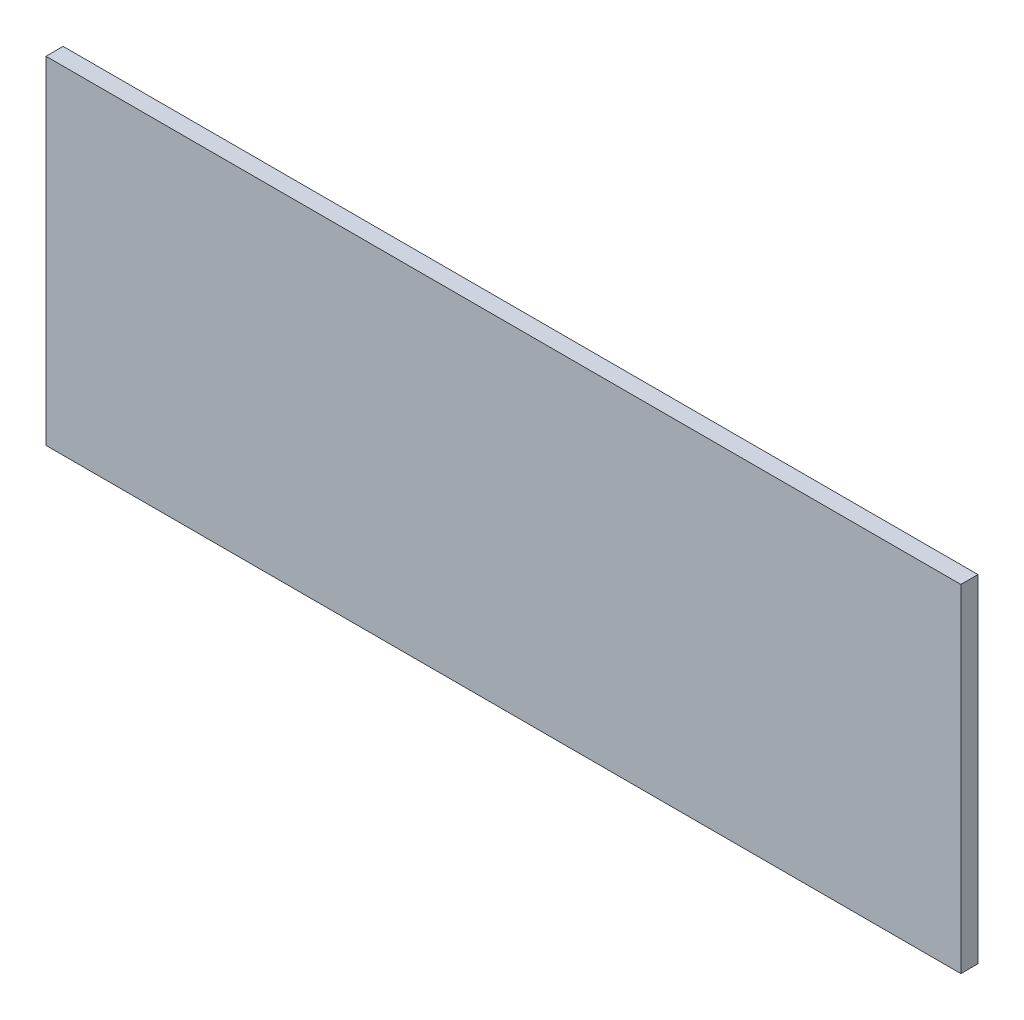
ISO-10303-21;
HEADER;
FILE_DESCRIPTION(('STEP AP214'),'2;1');
FILE_NAME('part.step','',(''),(''),'','','');
FILE_SCHEMA(('AUTOMOTIVE_DESIGN { 1 0 10303 214 1 1 1 1 }'));
ENDSEC;
DATA;
#1=APPLICATION_CONTEXT('core data for automotive mechanical design processes');
#2=APPLICATION_PROTOCOL_DEFINITION('international standard','automotive_design',2000,#1);
#3=PRODUCT_CONTEXT('',#1,'mechanical');
#4=PRODUCT('Part','Part','',(#3));
#5=PRODUCT_RELATED_PRODUCT_CATEGORY('part','',(#4));
#6=PRODUCT_DEFINITION_FORMATION('','',#4);
#7=PRODUCT_DEFINITION_CONTEXT('part definition',#1,'design');
#8=PRODUCT_DEFINITION('design','',#6,#7);
#9=PRODUCT_DEFINITION_SHAPE('','',#8);
#10=(LENGTH_UNIT() NAMED_UNIT(*) SI_UNIT(.MILLI.,.METRE.));
#11=(NAMED_UNIT(*) PLANE_ANGLE_UNIT() SI_UNIT($,.RADIAN.));
#12=(NAMED_UNIT(*) SI_UNIT($,.STERADIAN.) SOLID_ANGLE_UNIT());
#13=UNCERTAINTY_MEASURE_WITH_UNIT(LENGTH_MEASURE(1.E-05),#10,'distance_accuracy_value','');
#14=(GEOMETRIC_REPRESENTATION_CONTEXT(3) GLOBAL_UNCERTAINTY_ASSIGNED_CONTEXT((#13)) GLOBAL_UNIT_ASSIGNED_CONTEXT((#10,
#11,#12)) REPRESENTATION_CONTEXT('',''));
#15=CARTESIAN_POINT('',(0.,0.,0.));
#16=DIRECTION('',(0.,0.,1.));
#17=DIRECTION('',(1.,0.,0.));
#18=AXIS2_PLACEMENT_3D('',#15,#16,#17);
#19=CARTESIAN_POINT('',(96.5670013427734,60.0870018005371,0.));
#20=DIRECTION('',(0.,1.,0.));
#21=DIRECTION('',(1.,0.,0.));
#22=AXIS2_PLACEMENT_3D('',#19,#20,#21);
#23=PLANE('',#22);
#24=DIRECTION('',(1.,0.,0.));
#25=VECTOR('',#24,1.);
#26=CARTESIAN_POINT('',(96.5670013427734,60.0870018005371,0.03556));
#27=LINE('',#26,#25);
#28=CARTESIAN_POINT('',(96.5670013427734,60.0870018005371,0.03556));
#29=VERTEX_POINT('',#28);
#30=CARTESIAN_POINT('',(98.4670028686523,60.0870018005371,0.03556));
#31=VERTEX_POINT('',#30);
#32=EDGE_CURVE('E11',#29,#31,#27,.T.);
#33=ORIENTED_EDGE('',*,*,#32,.F.);
#34=DIRECTION('',(0.,0.,1.));
#35=VECTOR('',#34,1.);
#36=CARTESIAN_POINT('',(96.5670013427734,60.0870018005371,0.));
#37=LINE('',#36,#35);
#38=CARTESIAN_POINT('',(96.5670013427734,60.0870018005371,0.));
#39=VERTEX_POINT('',#38);
#40=EDGE_CURVE('E24',#39,#29,#37,.T.);
#41=ORIENTED_EDGE('',*,*,#40,.F.);
#42=DIRECTION('',(1.,0.,0.));
#43=VECTOR('',#42,1.);
#44=CARTESIAN_POINT('',(96.5670013427734,60.0870018005371,0.));
#45=LINE('',#44,#43);
#46=CARTESIAN_POINT('',(98.4670028686523,60.0870018005371,0.));
#47=VERTEX_POINT('',#46);
#48=EDGE_CURVE('E75',#39,#47,#45,.T.);
#49=ORIENTED_EDGE('',*,*,#48,.T.);
#50=DIRECTION('',(0.,0.,1.));
#51=VECTOR('',#50,1.);
#52=CARTESIAN_POINT('',(98.4670028686523,60.0870018005371,0.));
#53=LINE('',#52,#51);
#54=EDGE_CURVE('E37',#47,#31,#53,.T.);
#55=ORIENTED_EDGE('',*,*,#54,.T.);
#56=EDGE_LOOP('',(#33,#41,#49,#55));
#57=FACE_BOUND('',#56,.T.);
#58=ADVANCED_FACE('F17',(#57),#23,.F.);
#59=CARTESIAN_POINT('',(98.4670028686523,60.0870018005371,0.));
#60=DIRECTION('',(-1.,0.,0.));
#61=DIRECTION('',(0.,1.,0.));
#62=AXIS2_PLACEMENT_3D('',#59,#60,#61);
#63=PLANE('',#62);
#64=DIRECTION('',(0.,1.,0.));
#65=VECTOR('',#64,1.);
#66=CARTESIAN_POINT('',(98.4670028686523,60.0870018005371,0.03556));
#67=LINE('',#66,#65);
#68=CARTESIAN_POINT('',(98.4670028686523,60.7869987487793,0.03556));
#69=VERTEX_POINT('',#68);
#70=EDGE_CURVE('E83',#31,#69,#67,.T.);
#71=ORIENTED_EDGE('',*,*,#70,.F.);
#72=ORIENTED_EDGE('',*,*,#54,.F.);
#73=DIRECTION('',(0.,1.,0.));
#74=VECTOR('',#73,1.);
#75=CARTESIAN_POINT('',(98.4670028686523,60.0870018005371,0.));
#76=LINE('',#75,#74);
#77=CARTESIAN_POINT('',(98.4670028686523,60.7869987487793,0.));
#78=VERTEX_POINT('',#77);
#79=EDGE_CURVE('E81',#47,#78,#76,.T.);
#80=ORIENTED_EDGE('',*,*,#79,.T.);
#81=DIRECTION('',(0.,0.,1.));
#82=VECTOR('',#81,1.);
#83=CARTESIAN_POINT('',(98.4670028686523,60.7869987487793,0.));
#84=LINE('',#83,#82);
#85=EDGE_CURVE('E67',#78,#69,#84,.T.);
#86=ORIENTED_EDGE('',*,*,#85,.T.);
#87=EDGE_LOOP('',(#71,#72,#80,#86));
#88=FACE_BOUND('',#87,.T.);
#89=ADVANCED_FACE('F89',(#88),#63,.F.);
#90=CARTESIAN_POINT('',(98.4670028686523,60.7869987487793,0.));
#91=DIRECTION('',(0.,-1.,0.));
#92=DIRECTION('',(-1.,0.,0.));
#93=AXIS2_PLACEMENT_3D('',#90,#91,#92);
#94=PLANE('',#93);
#95=DIRECTION('',(-1.,0.,0.));
#96=VECTOR('',#95,1.);
#97=CARTESIAN_POINT('',(98.4670028686523,60.7869987487793,0.03556));
#98=LINE('',#97,#96);
#99=CARTESIAN_POINT('',(96.5670013427734,60.7869987487793,0.03556));
#100=VERTEX_POINT('',#99);
#101=EDGE_CURVE('E71',#69,#100,#98,.T.);
#102=ORIENTED_EDGE('',*,*,#101,.F.);
#103=ORIENTED_EDGE('',*,*,#85,.F.);
#104=DIRECTION('',(-1.,0.,0.));
#105=VECTOR('',#104,1.);
#106=CARTESIAN_POINT('',(98.4670028686523,60.7869987487793,0.));
#107=LINE('',#106,#105);
#108=CARTESIAN_POINT('',(96.5670013427734,60.7869987487793,0.));
#109=VERTEX_POINT('',#108);
#110=EDGE_CURVE('E63',#78,#109,#107,.T.);
#111=ORIENTED_EDGE('',*,*,#110,.T.);
#112=DIRECTION('',(0.,0.,1.));
#113=VECTOR('',#112,1.);
#114=CARTESIAN_POINT('',(96.5670013427734,60.7869987487793,0.));
#115=LINE('',#114,#113);
#116=EDGE_CURVE('E53',#109,#100,#115,.T.);
#117=ORIENTED_EDGE('',*,*,#116,.T.);
#118=EDGE_LOOP('',(#102,#103,#111,#117));
#119=FACE_BOUND('',#118,.T.);
#120=ADVANCED_FACE('F66',(#119),#94,.F.);
#121=CARTESIAN_POINT('',(96.5670013427734,60.7869987487793,0.));
#122=DIRECTION('',(1.,0.,0.));
#123=DIRECTION('',(0.,-1.,0.));
#124=AXIS2_PLACEMENT_3D('',#121,#122,#123);
#125=PLANE('',#124);
#126=DIRECTION('',(0.,-1.,0.));
#127=VECTOR('',#126,1.);
#128=CARTESIAN_POINT('',(96.5670013427734,60.7869987487793,0.03556));
#129=LINE('',#128,#127);
#130=EDGE_CURVE('E59',#100,#29,#129,.T.);
#131=ORIENTED_EDGE('',*,*,#130,.F.);
#132=ORIENTED_EDGE('',*,*,#116,.F.);
#133=DIRECTION('',(0.,-1.,0.));
#134=VECTOR('',#133,1.);
#135=CARTESIAN_POINT('',(96.5670013427734,60.7869987487793,0.));
#136=LINE('',#135,#134);
#137=EDGE_CURVE('E57',#109,#39,#136,.T.);
#138=ORIENTED_EDGE('',*,*,#137,.T.);
#139=ORIENTED_EDGE('',*,*,#40,.T.);
#140=EDGE_LOOP('',(#131,#132,#138,#139));
#141=FACE_BOUND('',#140,.T.);
#142=ADVANCED_FACE('F55',(#141),#125,.F.);
#143=CARTESIAN_POINT('',(96.5670013427734,60.0870018005371,0.));
#144=DIRECTION('',(0.,0.,-1.));
#145=DIRECTION('',(-1.,0.,0.));
#146=AXIS2_PLACEMENT_3D('',#143,#144,#145);
#147=PLANE('',#146);
#148=ORIENTED_EDGE('',*,*,#137,.F.);
#149=ORIENTED_EDGE('',*,*,#110,.F.);
#150=ORIENTED_EDGE('',*,*,#79,.F.);
#151=ORIENTED_EDGE('',*,*,#48,.F.);
#152=EDGE_LOOP('',(#148,#149,#150,#151));
#153=FACE_BOUND('',#152,.T.);
#154=ADVANCED_FACE('F74',(#153),#147,.T.);
#155=CARTESIAN_POINT('',(96.5670013427734,60.0870018005371,0.03556));
#156=DIRECTION('',(0.,0.,-1.));
#157=DIRECTION('',(-1.,0.,0.));
#158=AXIS2_PLACEMENT_3D('',#155,#156,#157);
#159=PLANE('',#158);
#160=ORIENTED_EDGE('',*,*,#32,.T.);
#161=ORIENTED_EDGE('',*,*,#70,.T.);
#162=ORIENTED_EDGE('',*,*,#101,.T.);
#163=ORIENTED_EDGE('',*,*,#130,.T.);
#164=EDGE_LOOP('',(#160,#161,#162,#163));
#165=FACE_BOUND('',#164,.T.);
#166=ADVANCED_FACE('F91',(#165),#159,.F.);
#167=CLOSED_SHELL('',(#58,#89,#120,#142,#154,#166));
#168=MANIFOLD_SOLID_BREP('B1',#167);
#169=ADVANCED_BREP_SHAPE_REPRESENTATION('',(#18,#168),#14);
#170=SHAPE_DEFINITION_REPRESENTATION(#9,#169);
ENDSEC;
END-ISO-10303-21;
